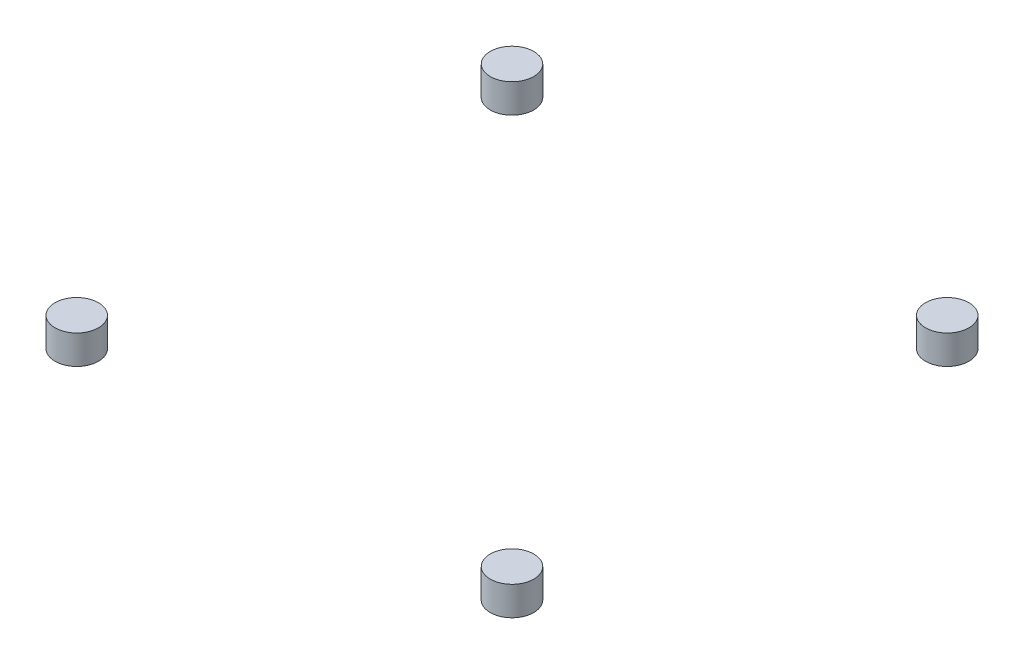
ISO-10303-21;
HEADER;
FILE_DESCRIPTION(('STEP AP214'),'2;1');
FILE_NAME('part.step','',(''),(''),'','','');
FILE_SCHEMA(('AUTOMOTIVE_DESIGN { 1 0 10303 214 1 1 1 1 }'));
ENDSEC;
DATA;
#1=APPLICATION_CONTEXT('core data for automotive mechanical design processes');
#2=APPLICATION_PROTOCOL_DEFINITION('international standard','automotive_design',2000,#1);
#3=PRODUCT_CONTEXT('',#1,'mechanical');
#4=PRODUCT('Part','Part','',(#3));
#5=PRODUCT_RELATED_PRODUCT_CATEGORY('part','',(#4));
#6=PRODUCT_DEFINITION_FORMATION('','',#4);
#7=PRODUCT_DEFINITION_CONTEXT('part definition',#1,'design');
#8=PRODUCT_DEFINITION('design','',#6,#7);
#9=PRODUCT_DEFINITION_SHAPE('','',#8);
#10=(LENGTH_UNIT() NAMED_UNIT(*) SI_UNIT(.MILLI.,.METRE.));
#11=(NAMED_UNIT(*) PLANE_ANGLE_UNIT() SI_UNIT($,.RADIAN.));
#12=(NAMED_UNIT(*) SI_UNIT($,.STERADIAN.) SOLID_ANGLE_UNIT());
#13=UNCERTAINTY_MEASURE_WITH_UNIT(LENGTH_MEASURE(1.E-05),#10,'distance_accuracy_value','');
#14=(GEOMETRIC_REPRESENTATION_CONTEXT(3) GLOBAL_UNCERTAINTY_ASSIGNED_CONTEXT((#13)) GLOBAL_UNIT_ASSIGNED_CONTEXT((#10,
#11,#12)) REPRESENTATION_CONTEXT('',''));
#15=CARTESIAN_POINT('',(0.,0.,0.));
#16=DIRECTION('',(0.,0.,1.));
#17=DIRECTION('',(1.,0.,0.));
#18=AXIS2_PLACEMENT_3D('',#15,#16,#17);
#19=CARTESIAN_POINT('',(0.,10.,0.));
#20=DIRECTION('',(0.,-1.,0.));
#21=DIRECTION('',(0.,0.,-1.));
#22=AXIS2_PLACEMENT_3D('',#19,#20,#21);
#23=CYLINDRICAL_SURFACE('',#22,7.5);
#24=CARTESIAN_POINT('',(0.,10.,0.));
#25=DIRECTION('',(0.,1.,0.));
#26=DIRECTION('',(0.,0.,1.));
#27=AXIS2_PLACEMENT_3D('',#24,#25,#26);
#28=CIRCLE('',#27,7.5);
#29=CARTESIAN_POINT('',(0.,10.,7.5));
#30=VERTEX_POINT('',#29);
#31=EDGE_CURVE('E11',#30,#30,#28,.T.);
#32=ORIENTED_EDGE('',*,*,#31,.F.);
#33=EDGE_LOOP('',(#32));
#34=FACE_BOUND('',#33,.T.);
#35=CARTESIAN_POINT('',(0.,0.,0.));
#36=DIRECTION('',(0.,1.,0.));
#37=DIRECTION('',(0.,0.,1.));
#38=AXIS2_PLACEMENT_3D('',#35,#36,#37);
#39=CIRCLE('',#38,7.5);
#40=CARTESIAN_POINT('',(0.,0.,7.5));
#41=VERTEX_POINT('',#40);
#42=EDGE_CURVE('E43',#41,#41,#39,.T.);
#43=ORIENTED_EDGE('',*,*,#42,.T.);
#44=EDGE_LOOP('',(#43));
#45=FACE_BOUND('',#44,.T.);
#46=ADVANCED_FACE('F40',(#34,#45),#23,.T.);
#47=CARTESIAN_POINT('',(0.,10.,0.));
#48=DIRECTION('',(0.,1.,0.));
#49=DIRECTION('',(0.,0.,1.));
#50=AXIS2_PLACEMENT_3D('',#47,#48,#49);
#51=PLANE('',#50);
#52=ORIENTED_EDGE('',*,*,#31,.T.);
#53=EDGE_LOOP('',(#52));
#54=FACE_BOUND('',#53,.T.);
#55=ADVANCED_FACE('F55',(#54),#51,.T.);
#56=CARTESIAN_POINT('',(0.,0.,0.));
#57=DIRECTION('',(0.,1.,0.));
#58=DIRECTION('',(0.,0.,1.));
#59=AXIS2_PLACEMENT_3D('',#56,#57,#58);
#60=PLANE('',#59);
#61=ORIENTED_EDGE('',*,*,#42,.F.);
#62=EDGE_LOOP('',(#61));
#63=FACE_BOUND('',#62,.T.);
#64=ADVANCED_FACE('F53',(#63),#60,.F.);
#65=CLOSED_SHELL('',(#46,#55,#64));
#66=MANIFOLD_SOLID_BREP('B2',#65);
#67=CARTESIAN_POINT('',(150.,10.,0.));
#68=DIRECTION('',(0.,-1.,0.));
#69=DIRECTION('',(0.,0.,-1.));
#70=AXIS2_PLACEMENT_3D('',#67,#68,#69);
#71=CYLINDRICAL_SURFACE('',#70,7.50000000000001);
#72=CARTESIAN_POINT('',(150.,10.,0.));
#73=DIRECTION('',(0.,1.,0.));
#74=DIRECTION('',(0.,0.,1.));
#75=AXIS2_PLACEMENT_3D('',#72,#73,#74);
#76=CIRCLE('',#75,7.50000000000001);
#77=CARTESIAN_POINT('',(150.,10.,7.50000000000001));
#78=VERTEX_POINT('',#77);
#79=EDGE_CURVE('E39',#78,#78,#76,.T.);
#80=ORIENTED_EDGE('',*,*,#79,.F.);
#81=EDGE_LOOP('',(#80));
#82=FACE_BOUND('',#81,.T.);
#83=CARTESIAN_POINT('',(150.,0.,0.));
#84=DIRECTION('',(0.,1.,0.));
#85=DIRECTION('',(0.,0.,1.));
#86=AXIS2_PLACEMENT_3D('',#83,#84,#85);
#87=CIRCLE('',#86,7.50000000000001);
#88=CARTESIAN_POINT('',(150.,0.,7.50000000000001));
#89=VERTEX_POINT('',#88);
#90=EDGE_CURVE('E92',#89,#89,#87,.T.);
#91=ORIENTED_EDGE('',*,*,#90,.T.);
#92=EDGE_LOOP('',(#91));
#93=FACE_BOUND('',#92,.T.);
#94=ADVANCED_FACE('F89',(#82,#93),#71,.T.);
#95=CARTESIAN_POINT('',(150.,10.,0.));
#96=DIRECTION('',(0.,1.,0.));
#97=DIRECTION('',(0.,0.,1.));
#98=AXIS2_PLACEMENT_3D('',#95,#96,#97);
#99=PLANE('',#98);
#100=ORIENTED_EDGE('',*,*,#79,.T.);
#101=EDGE_LOOP('',(#100));
#102=FACE_BOUND('',#101,.T.);
#103=ADVANCED_FACE('F104',(#102),#99,.T.);
#104=CARTESIAN_POINT('',(150.,0.,0.));
#105=DIRECTION('',(0.,1.,0.));
#106=DIRECTION('',(0.,0.,1.));
#107=AXIS2_PLACEMENT_3D('',#104,#105,#106);
#108=PLANE('',#107);
#109=ORIENTED_EDGE('',*,*,#90,.F.);
#110=EDGE_LOOP('',(#109));
#111=FACE_BOUND('',#110,.T.);
#112=ADVANCED_FACE('F102',(#111),#108,.F.);
#113=CLOSED_SHELL('',(#94,#103,#112));
#114=MANIFOLD_SOLID_BREP('B6',#113);
#115=CARTESIAN_POINT('',(150.,10.,-150.));
#116=DIRECTION('',(0.,-1.,0.));
#117=DIRECTION('',(0.,0.,-1.));
#118=AXIS2_PLACEMENT_3D('',#115,#116,#117);
#119=CYLINDRICAL_SURFACE('',#118,7.50000000000001);
#120=CARTESIAN_POINT('',(150.,10.,-150.));
#121=DIRECTION('',(0.,1.,0.));
#122=DIRECTION('',(0.,0.,1.));
#123=AXIS2_PLACEMENT_3D('',#120,#121,#122);
#124=CIRCLE('',#123,7.50000000000001);
#125=CARTESIAN_POINT('',(150.,10.,-142.5));
#126=VERTEX_POINT('',#125);
#127=EDGE_CURVE('E88',#126,#126,#124,.T.);
#128=ORIENTED_EDGE('',*,*,#127,.F.);
#129=EDGE_LOOP('',(#128));
#130=FACE_BOUND('',#129,.T.);
#131=CARTESIAN_POINT('',(150.,0.,-150.));
#132=DIRECTION('',(0.,1.,0.));
#133=DIRECTION('',(0.,0.,1.));
#134=AXIS2_PLACEMENT_3D('',#131,#132,#133);
#135=CIRCLE('',#134,7.50000000000001);
#136=CARTESIAN_POINT('',(150.,0.,-142.5));
#137=VERTEX_POINT('',#136);
#138=EDGE_CURVE('E140',#137,#137,#135,.T.);
#139=ORIENTED_EDGE('',*,*,#138,.T.);
#140=EDGE_LOOP('',(#139));
#141=FACE_BOUND('',#140,.T.);
#142=ADVANCED_FACE('F137',(#130,#141),#119,.T.);
#143=CARTESIAN_POINT('',(150.,10.,-150.));
#144=DIRECTION('',(0.,1.,0.));
#145=DIRECTION('',(0.,0.,1.));
#146=AXIS2_PLACEMENT_3D('',#143,#144,#145);
#147=PLANE('',#146);
#148=ORIENTED_EDGE('',*,*,#127,.T.);
#149=EDGE_LOOP('',(#148));
#150=FACE_BOUND('',#149,.T.);
#151=ADVANCED_FACE('F152',(#150),#147,.T.);
#152=CARTESIAN_POINT('',(150.,0.,-150.));
#153=DIRECTION('',(0.,1.,0.));
#154=DIRECTION('',(0.,0.,1.));
#155=AXIS2_PLACEMENT_3D('',#152,#153,#154);
#156=PLANE('',#155);
#157=ORIENTED_EDGE('',*,*,#138,.F.);
#158=EDGE_LOOP('',(#157));
#159=FACE_BOUND('',#158,.T.);
#160=ADVANCED_FACE('F150',(#159),#156,.F.);
#161=CLOSED_SHELL('',(#142,#151,#160));
#162=MANIFOLD_SOLID_BREP('B34',#161);
#163=CARTESIAN_POINT('',(0.,10.,-150.));
#164=DIRECTION('',(0.,-1.,0.));
#165=DIRECTION('',(0.,0.,-1.));
#166=AXIS2_PLACEMENT_3D('',#163,#164,#165);
#167=CYLINDRICAL_SURFACE('',#166,7.5);
#168=CARTESIAN_POINT('',(0.,10.,-150.));
#169=DIRECTION('',(0.,1.,0.));
#170=DIRECTION('',(0.,0.,1.));
#171=AXIS2_PLACEMENT_3D('',#168,#169,#170);
#172=CIRCLE('',#171,7.5);
#173=CARTESIAN_POINT('',(0.,10.,-142.5));
#174=VERTEX_POINT('',#173);
#175=EDGE_CURVE('E136',#174,#174,#172,.T.);
#176=ORIENTED_EDGE('',*,*,#175,.F.);
#177=EDGE_LOOP('',(#176));
#178=FACE_BOUND('',#177,.T.);
#179=CARTESIAN_POINT('',(0.,0.,-150.));
#180=DIRECTION('',(0.,1.,0.));
#181=DIRECTION('',(0.,0.,1.));
#182=AXIS2_PLACEMENT_3D('',#179,#180,#181);
#183=CIRCLE('',#182,7.5);
#184=CARTESIAN_POINT('',(0.,0.,-142.5));
#185=VERTEX_POINT('',#184);
#186=EDGE_CURVE('E181',#185,#185,#183,.T.);
#187=ORIENTED_EDGE('',*,*,#186,.T.);
#188=EDGE_LOOP('',(#187));
#189=FACE_BOUND('',#188,.T.);
#190=ADVANCED_FACE('F178',(#178,#189),#167,.T.);
#191=CARTESIAN_POINT('',(0.,10.,-150.));
#192=DIRECTION('',(0.,1.,0.));
#193=DIRECTION('',(0.,0.,1.));
#194=AXIS2_PLACEMENT_3D('',#191,#192,#193);
#195=PLANE('',#194);
#196=ORIENTED_EDGE('',*,*,#175,.T.);
#197=EDGE_LOOP('',(#196));
#198=FACE_BOUND('',#197,.T.);
#199=ADVANCED_FACE('F193',(#198),#195,.T.);
#200=CARTESIAN_POINT('',(0.,0.,-150.));
#201=DIRECTION('',(0.,1.,0.));
#202=DIRECTION('',(0.,0.,1.));
#203=AXIS2_PLACEMENT_3D('',#200,#201,#202);
#204=PLANE('',#203);
#205=ORIENTED_EDGE('',*,*,#186,.F.);
#206=EDGE_LOOP('',(#205));
#207=FACE_BOUND('',#206,.T.);
#208=ADVANCED_FACE('F191',(#207),#204,.F.);
#209=CLOSED_SHELL('',(#190,#199,#208));
#210=MANIFOLD_SOLID_BREP('B83',#209);
#211=ADVANCED_BREP_SHAPE_REPRESENTATION('',(#18,#66,#114,#162,#210),#14);
#212=SHAPE_DEFINITION_REPRESENTATION(#9,#211);
ENDSEC;
END-ISO-10303-21;
